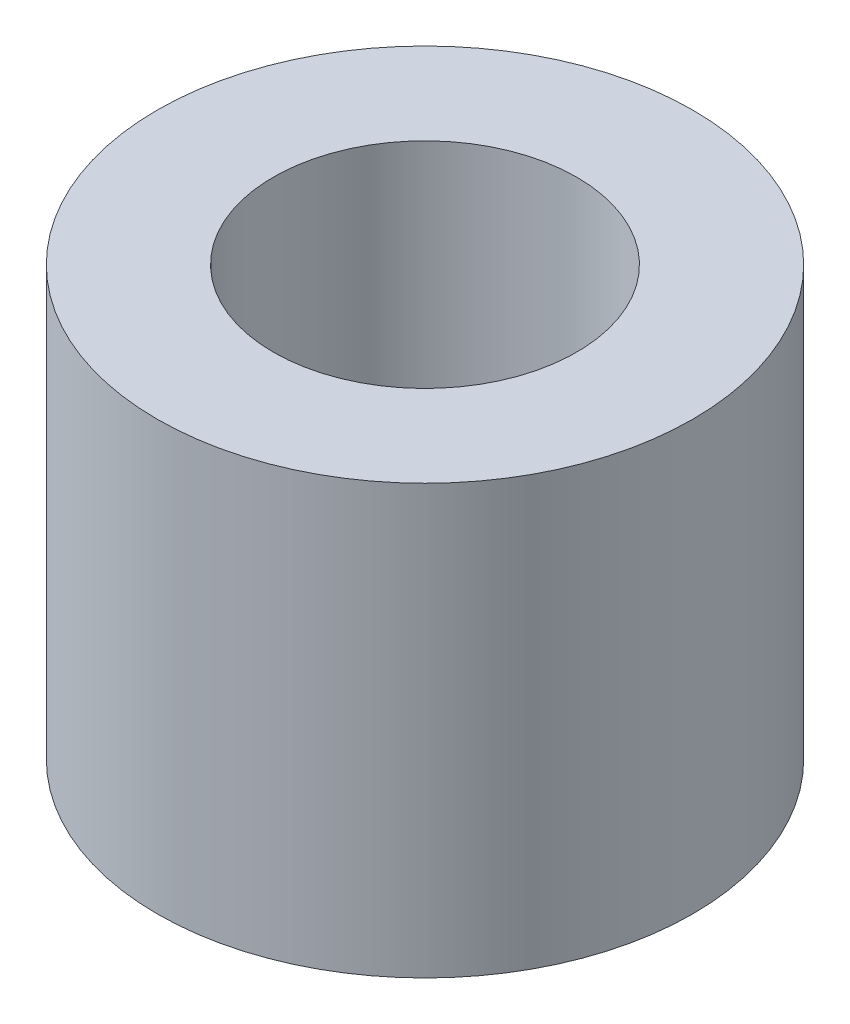
ISO-10303-21;
HEADER;
FILE_DESCRIPTION(('STEP AP214'),'2;1');
FILE_NAME('part.step','',(''),(''),'','','');
FILE_SCHEMA(('AUTOMOTIVE_DESIGN { 1 0 10303 214 1 1 1 1 }'));
ENDSEC;
DATA;
#1=APPLICATION_CONTEXT('core data for automotive mechanical design processes');
#2=APPLICATION_PROTOCOL_DEFINITION('international standard','automotive_design',2000,#1);
#3=PRODUCT_CONTEXT('',#1,'mechanical');
#4=PRODUCT('Part','Part','',(#3));
#5=PRODUCT_RELATED_PRODUCT_CATEGORY('part','',(#4));
#6=PRODUCT_DEFINITION_FORMATION('','',#4);
#7=PRODUCT_DEFINITION_CONTEXT('part definition',#1,'design');
#8=PRODUCT_DEFINITION('design','',#6,#7);
#9=PRODUCT_DEFINITION_SHAPE('','',#8);
#10=(LENGTH_UNIT() NAMED_UNIT(*) SI_UNIT(.MILLI.,.METRE.));
#11=(NAMED_UNIT(*) PLANE_ANGLE_UNIT() SI_UNIT($,.RADIAN.));
#12=(NAMED_UNIT(*) SI_UNIT($,.STERADIAN.) SOLID_ANGLE_UNIT());
#13=UNCERTAINTY_MEASURE_WITH_UNIT(LENGTH_MEASURE(1.E-05),#10,'distance_accuracy_value','');
#14=(GEOMETRIC_REPRESENTATION_CONTEXT(3) GLOBAL_UNCERTAINTY_ASSIGNED_CONTEXT((#13)) GLOBAL_UNIT_ASSIGNED_CONTEXT((#10,
#11,#12)) REPRESENTATION_CONTEXT('',''));
#15=CARTESIAN_POINT('',(0.,0.,0.));
#16=DIRECTION('',(0.,0.,1.));
#17=DIRECTION('',(1.,0.,0.));
#18=AXIS2_PLACEMENT_3D('',#15,#16,#17);
#19=CARTESIAN_POINT('',(0.,6.35,0.));
#20=DIRECTION('',(0.,1.,0.));
#21=DIRECTION('',(0.,0.,1.));
#22=AXIS2_PLACEMENT_3D('',#19,#20,#21);
#23=PLANE('',#22);
#24=CARTESIAN_POINT('',(0.,6.35,0.));
#25=DIRECTION('',(0.,1.,0.));
#26=DIRECTION('',(0.,0.,1.));
#27=AXIS2_PLACEMENT_3D('',#24,#25,#26);
#28=CIRCLE('',#27,3.96875);
#29=CARTESIAN_POINT('',(0.,6.35,3.96875));
#30=VERTEX_POINT('',#29);
#31=EDGE_CURVE('E10',#30,#30,#28,.T.);
#32=ORIENTED_EDGE('',*,*,#31,.T.);
#33=EDGE_LOOP('',(#32));
#34=FACE_BOUND('',#33,.T.);
#35=CARTESIAN_POINT('',(0.,6.35,0.));
#36=DIRECTION('',(0.,1.,0.));
#37=DIRECTION('',(0.,0.,1.));
#38=AXIS2_PLACEMENT_3D('',#35,#36,#37);
#39=CIRCLE('',#38,2.2479);
#40=CARTESIAN_POINT('',(0.,6.35,2.2479));
#41=VERTEX_POINT('',#40);
#42=EDGE_CURVE('E42',#41,#41,#39,.T.);
#43=ORIENTED_EDGE('',*,*,#42,.F.);
#44=EDGE_LOOP('',(#43));
#45=FACE_BOUND('',#44,.T.);
#46=ADVANCED_FACE('F31',(#34,#45),#23,.T.);
#47=CARTESIAN_POINT('',(0.,0.,0.));
#48=DIRECTION('',(0.,1.,0.));
#49=DIRECTION('',(0.,0.,1.));
#50=AXIS2_PLACEMENT_3D('',#47,#48,#49);
#51=PLANE('',#50);
#52=CARTESIAN_POINT('',(0.,0.,0.));
#53=DIRECTION('',(0.,1.,0.));
#54=DIRECTION('',(0.,0.,1.));
#55=AXIS2_PLACEMENT_3D('',#52,#53,#54);
#56=CIRCLE('',#55,3.96875);
#57=CARTESIAN_POINT('',(0.,0.,3.96875));
#58=VERTEX_POINT('',#57);
#59=EDGE_CURVE('E35',#58,#58,#56,.T.);
#60=ORIENTED_EDGE('',*,*,#59,.F.);
#61=EDGE_LOOP('',(#60));
#62=FACE_BOUND('',#61,.T.);
#63=CARTESIAN_POINT('',(0.,0.,0.));
#64=DIRECTION('',(0.,1.,0.));
#65=DIRECTION('',(0.,0.,1.));
#66=AXIS2_PLACEMENT_3D('',#63,#64,#65);
#67=CIRCLE('',#66,2.2479);
#68=CARTESIAN_POINT('',(0.,0.,2.2479));
#69=VERTEX_POINT('',#68);
#70=EDGE_CURVE('E44',#69,#69,#67,.T.);
#71=ORIENTED_EDGE('',*,*,#70,.T.);
#72=EDGE_LOOP('',(#71));
#73=FACE_BOUND('',#72,.T.);
#74=ADVANCED_FACE('F54',(#62,#73),#51,.F.);
#75=CARTESIAN_POINT('',(0.,6.35,0.));
#76=DIRECTION('',(0.,-1.,0.));
#77=DIRECTION('',(0.,0.,-1.));
#78=AXIS2_PLACEMENT_3D('',#75,#76,#77);
#79=CYLINDRICAL_SURFACE('',#78,3.96875);
#80=ORIENTED_EDGE('',*,*,#31,.F.);
#81=EDGE_LOOP('',(#80));
#82=FACE_BOUND('',#81,.T.);
#83=ORIENTED_EDGE('',*,*,#59,.T.);
#84=EDGE_LOOP('',(#83));
#85=FACE_BOUND('',#84,.T.);
#86=ADVANCED_FACE('F33',(#82,#85),#79,.T.);
#87=CARTESIAN_POINT('',(0.,6.35,0.));
#88=DIRECTION('',(0.,-1.,0.));
#89=DIRECTION('',(0.,0.,-1.));
#90=AXIS2_PLACEMENT_3D('',#87,#88,#89);
#91=CYLINDRICAL_SURFACE('',#90,2.2479);
#92=ORIENTED_EDGE('',*,*,#42,.T.);
#93=EDGE_LOOP('',(#92));
#94=FACE_BOUND('',#93,.T.);
#95=ORIENTED_EDGE('',*,*,#70,.F.);
#96=EDGE_LOOP('',(#95));
#97=FACE_BOUND('',#96,.T.);
#98=ADVANCED_FACE('F50',(#94,#97),#91,.F.);
#99=CLOSED_SHELL('',(#46,#74,#86,#98));
#100=MANIFOLD_SOLID_BREP('B2',#99);
#101=ADVANCED_BREP_SHAPE_REPRESENTATION('',(#18,#100),#14);
#102=SHAPE_DEFINITION_REPRESENTATION(#9,#101);
ENDSEC;
END-ISO-10303-21;
